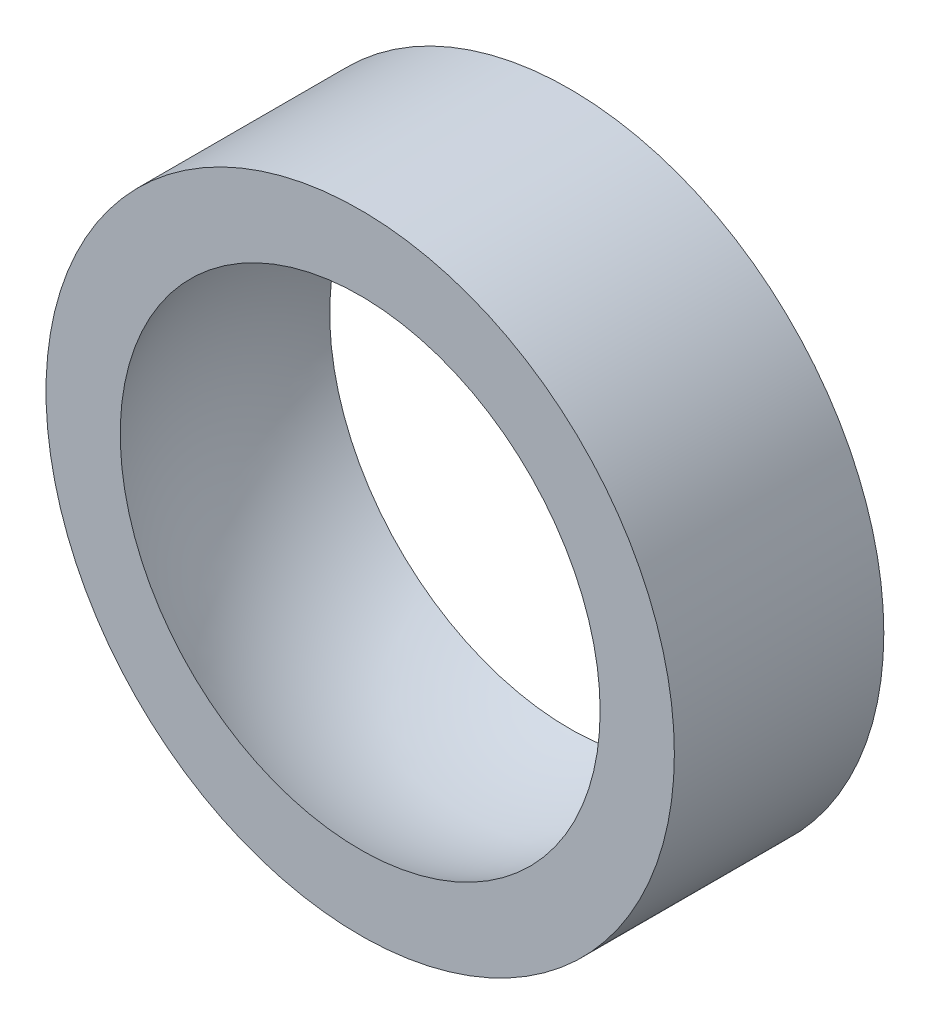
ISO-10303-21;
HEADER;
FILE_DESCRIPTION(('STEP AP214'),'2;1');
FILE_NAME('part.step','',(''),(''),'','','');
FILE_SCHEMA(('AUTOMOTIVE_DESIGN { 1 0 10303 214 1 1 1 1 }'));
ENDSEC;
DATA;
#1=APPLICATION_CONTEXT('core data for automotive mechanical design processes');
#2=APPLICATION_PROTOCOL_DEFINITION('international standard','automotive_design',2000,#1);
#3=PRODUCT_CONTEXT('',#1,'mechanical');
#4=PRODUCT('Part','Part','',(#3));
#5=PRODUCT_RELATED_PRODUCT_CATEGORY('part','',(#4));
#6=PRODUCT_DEFINITION_FORMATION('','',#4);
#7=PRODUCT_DEFINITION_CONTEXT('part definition',#1,'design');
#8=PRODUCT_DEFINITION('design','',#6,#7);
#9=PRODUCT_DEFINITION_SHAPE('','',#8);
#10=(LENGTH_UNIT() NAMED_UNIT(*) SI_UNIT(.MILLI.,.METRE.));
#11=(NAMED_UNIT(*) PLANE_ANGLE_UNIT() SI_UNIT($,.RADIAN.));
#12=(NAMED_UNIT(*) SI_UNIT($,.STERADIAN.) SOLID_ANGLE_UNIT());
#13=UNCERTAINTY_MEASURE_WITH_UNIT(LENGTH_MEASURE(1.E-05),#10,'distance_accuracy_value','');
#14=(GEOMETRIC_REPRESENTATION_CONTEXT(3) GLOBAL_UNCERTAINTY_ASSIGNED_CONTEXT((#13)) GLOBAL_UNIT_ASSIGNED_CONTEXT((#10,
#11,#12)) REPRESENTATION_CONTEXT('',''));
#15=CARTESIAN_POINT('',(0.,0.,0.));
#16=DIRECTION('',(0.,0.,1.));
#17=DIRECTION('',(1.,0.,0.));
#18=AXIS2_PLACEMENT_3D('',#15,#16,#17);
#19=CARTESIAN_POINT('',(0.,0.,5.));
#20=DIRECTION('',(0.,0.,1.));
#21=DIRECTION('',(1.,0.,0.));
#22=AXIS2_PLACEMENT_3D('',#19,#20,#21);
#23=PLANE('',#22);
#24=CARTESIAN_POINT('',(0.,0.,5.));
#25=DIRECTION('',(0.,0.,1.));
#26=DIRECTION('',(1.,0.,0.));
#27=AXIS2_PLACEMENT_3D('',#24,#25,#26);
#28=CIRCLE('',#27,15.);
#29=CARTESIAN_POINT('',(15.,0.,4.99999999999998));
#30=VERTEX_POINT('',#29);
#31=EDGE_CURVE('E10',#30,#30,#28,.T.);
#32=ORIENTED_EDGE('',*,*,#31,.T.);
#33=EDGE_LOOP('',(#32));
#34=FACE_BOUND('',#33,.T.);
#35=CARTESIAN_POINT('',(0.,0.,5.));
#36=DIRECTION('',(0.,0.,1.));
#37=DIRECTION('',(1.,0.,0.));
#38=AXIS2_PLACEMENT_3D('',#35,#36,#37);
#39=CIRCLE('',#38,11.4564392373896);
#40=CARTESIAN_POINT('',(11.4564392373896,0.,4.99999999999999));
#41=VERTEX_POINT('',#40);
#42=EDGE_CURVE('E57',#41,#41,#39,.F.);
#43=ORIENTED_EDGE('',*,*,#42,.T.);
#44=EDGE_LOOP('',(#43));
#45=FACE_BOUND('',#44,.T.);
#46=ADVANCED_FACE('F42',(#34,#45),#23,.T.);
#47=CARTESIAN_POINT('',(0.,0.,-5.));
#48=DIRECTION('',(0.,0.,1.));
#49=DIRECTION('',(1.,0.,0.));
#50=AXIS2_PLACEMENT_3D('',#47,#48,#49);
#51=PLANE('',#50);
#52=CARTESIAN_POINT('',(0.,0.,-5.));
#53=DIRECTION('',(0.,0.,1.));
#54=DIRECTION('',(1.,0.,0.));
#55=AXIS2_PLACEMENT_3D('',#52,#53,#54);
#56=CIRCLE('',#55,15.);
#57=CARTESIAN_POINT('',(15.,0.,-5.00000000000002));
#58=VERTEX_POINT('',#57);
#59=EDGE_CURVE('E51',#58,#58,#56,.T.);
#60=ORIENTED_EDGE('',*,*,#59,.F.);
#61=EDGE_LOOP('',(#60));
#62=FACE_BOUND('',#61,.T.);
#63=CARTESIAN_POINT('',(0.,0.,-5.));
#64=DIRECTION('',(0.,0.,1.));
#65=DIRECTION('',(1.,0.,0.));
#66=AXIS2_PLACEMENT_3D('',#63,#64,#65);
#67=CIRCLE('',#66,11.4564392373896);
#68=CARTESIAN_POINT('',(11.4564392373896,0.,-5.00000000000002));
#69=VERTEX_POINT('',#68);
#70=EDGE_CURVE('E46',#69,#69,#67,.F.);
#71=ORIENTED_EDGE('',*,*,#70,.F.);
#72=EDGE_LOOP('',(#71));
#73=FACE_BOUND('',#72,.T.);
#74=ADVANCED_FACE('F72',(#62,#73),#51,.F.);
#75=CARTESIAN_POINT('',(0.,0.,5.));
#76=DIRECTION('',(0.,0.,-1.));
#77=DIRECTION('',(-1.,0.,0.));
#78=AXIS2_PLACEMENT_3D('',#75,#76,#77);
#79=CYLINDRICAL_SURFACE('',#78,15.);
#80=ORIENTED_EDGE('',*,*,#31,.F.);
#81=EDGE_LOOP('',(#80));
#82=FACE_BOUND('',#81,.T.);
#83=ORIENTED_EDGE('',*,*,#59,.T.);
#84=EDGE_LOOP('',(#83));
#85=FACE_BOUND('',#84,.T.);
#86=ADVANCED_FACE('F44',(#82,#85),#79,.T.);
#87=CARTESIAN_POINT('',(0.,0.,0.));
#88=DIRECTION('',(0.,1.,0.));
#89=DIRECTION('',(1.,0.,0.));
#90=AXIS2_PLACEMENT_3D('',#87,#88,#89);
#91=SPHERICAL_SURFACE('',#90,12.5);
#92=CARTESIAN_POINT('',(0.,0.,0.));
#93=DIRECTION('',(0.,0.,1.));
#94=DIRECTION('',(1.,0.,0.));
#95=AXIS2_PLACEMENT_3D('',#92,#93,#94);
#96=SPHERICAL_SURFACE('',#95,12.5);
#97=ORIENTED_EDGE('',*,*,#42,.F.);
#98=EDGE_LOOP('',(#97));
#99=FACE_BOUND('',#98,.T.);
#100=ORIENTED_EDGE('',*,*,#70,.T.);
#101=EDGE_LOOP('',(#100));
#102=FACE_BOUND('',#101,.T.);
#103=ADVANCED_FACE('F70',(#99,#102),#96,.F.);
#104=CLOSED_SHELL('',(#46,#74,#86,#103));
#105=MANIFOLD_SOLID_BREP('B2',#104);
#106=ADVANCED_BREP_SHAPE_REPRESENTATION('',(#18,#105),#14);
#107=SHAPE_DEFINITION_REPRESENTATION(#9,#106);
ENDSEC;
END-ISO-10303-21;
